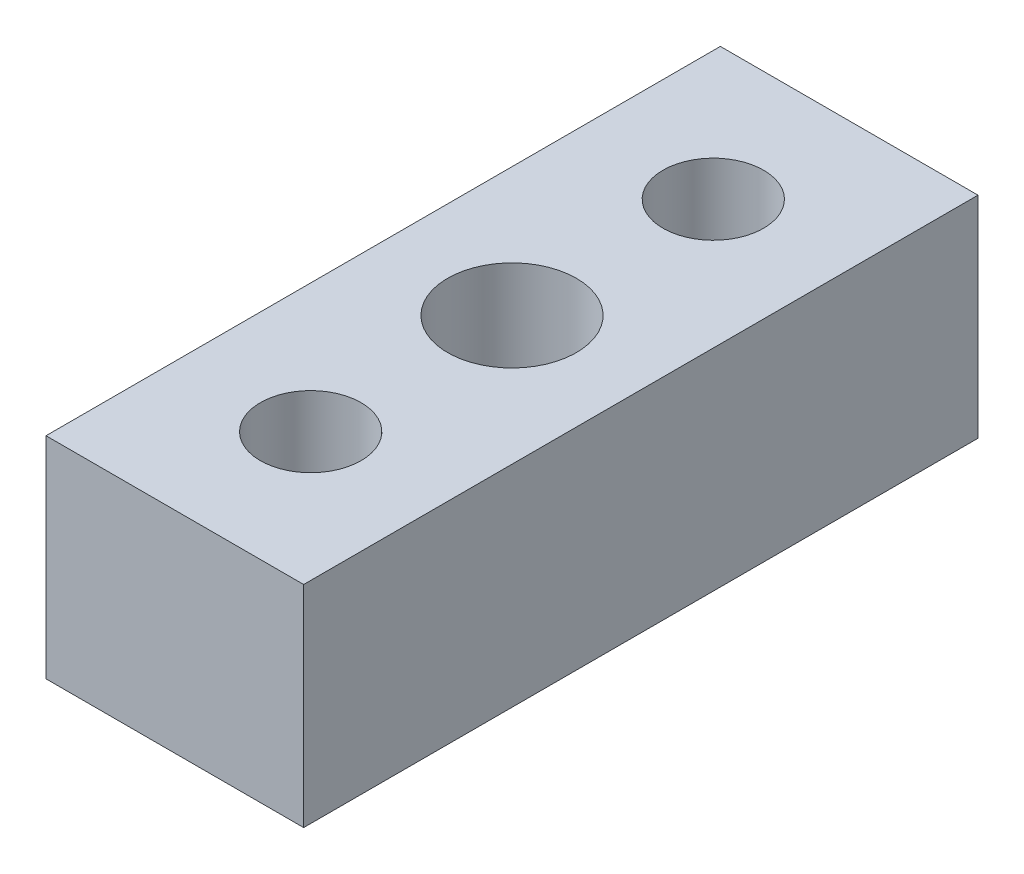
ISO-10303-21;
HEADER;
FILE_DESCRIPTION(('STEP AP214'),'2;1');
FILE_NAME('part.step','',(''),(''),'','','');
FILE_SCHEMA(('AUTOMOTIVE_DESIGN { 1 0 10303 214 1 1 1 1 }'));
ENDSEC;
DATA;
#1=APPLICATION_CONTEXT('core data for automotive mechanical design processes');
#2=APPLICATION_PROTOCOL_DEFINITION('international standard','automotive_design',2000,#1);
#3=PRODUCT_CONTEXT('',#1,'mechanical');
#4=PRODUCT('Part','Part','',(#3));
#5=PRODUCT_RELATED_PRODUCT_CATEGORY('part','',(#4));
#6=PRODUCT_DEFINITION_FORMATION('','',#4);
#7=PRODUCT_DEFINITION_CONTEXT('part definition',#1,'design');
#8=PRODUCT_DEFINITION('design','',#6,#7);
#9=PRODUCT_DEFINITION_SHAPE('','',#8);
#10=(LENGTH_UNIT() NAMED_UNIT(*) SI_UNIT(.MILLI.,.METRE.));
#11=(NAMED_UNIT(*) PLANE_ANGLE_UNIT() SI_UNIT($,.RADIAN.));
#12=(NAMED_UNIT(*) SI_UNIT($,.STERADIAN.) SOLID_ANGLE_UNIT());
#13=UNCERTAINTY_MEASURE_WITH_UNIT(LENGTH_MEASURE(1.E-05),#10,'distance_accuracy_value','');
#14=(GEOMETRIC_REPRESENTATION_CONTEXT(3) GLOBAL_UNCERTAINTY_ASSIGNED_CONTEXT((#13)) GLOBAL_UNIT_ASSIGNED_CONTEXT((#10,
#11,#12)) REPRESENTATION_CONTEXT('',''));
#15=CARTESIAN_POINT('',(0.,0.,0.));
#16=DIRECTION('',(0.,0.,1.));
#17=DIRECTION('',(1.,0.,0.));
#18=AXIS2_PLACEMENT_3D('',#15,#16,#17);
#19=CARTESIAN_POINT('',(-3.41700000000013,-2.11,8.37500000000002));
#20=DIRECTION('',(0.,0.,1.));
#21=DIRECTION('',(1.00000000000001,0.,0.));
#22=AXIS2_PLACEMENT_3D('',#19,#20,#21);
#23=PLANE('',#22);
#24=DIRECTION('',(1.00000000000001,0.,0.));
#25=VECTOR('',#24,1.);
#26=CARTESIAN_POINT('',(-3.41699999999999,3.12,8.37499999999996));
#27=LINE('',#26,#25);
#28=CARTESIAN_POINT('',(-3.20000000000002,3.12,8.37500000000002));
#29=VERTEX_POINT('',#28);
#30=CARTESIAN_POINT('',(3.20000000000013,3.12,8.37499999999998));
#31=VERTEX_POINT('',#30);
#32=EDGE_CURVE('E115',#29,#31,#27,.T.);
#33=ORIENTED_EDGE('',*,*,#32,.F.);
#34=DIRECTION('',(0.,-1.,0.));
#35=VECTOR('',#34,1.);
#36=CARTESIAN_POINT('',(-3.20000000000002,3.12,8.37500000000002));
#37=LINE('',#36,#35);
#38=CARTESIAN_POINT('',(-3.20000000000005,-2.11,8.37499999999999));
#39=VERTEX_POINT('',#38);
#40=EDGE_CURVE('E47',#29,#39,#37,.T.);
#41=ORIENTED_EDGE('',*,*,#40,.T.);
#42=DIRECTION('',(1.00000000000001,0.,0.));
#43=VECTOR('',#42,1.);
#44=CARTESIAN_POINT('',(-3.41700000000013,-2.11,8.37500000000002));
#45=LINE('',#44,#43);
#46=CARTESIAN_POINT('',(3.20000000000009,-2.11,8.375));
#47=VERTEX_POINT('',#46);
#48=EDGE_CURVE('E123',#39,#47,#45,.T.);
#49=ORIENTED_EDGE('',*,*,#48,.T.);
#50=DIRECTION('',(0.,-1.,0.));
#51=VECTOR('',#50,1.);
#52=CARTESIAN_POINT('',(3.20000000000013,3.12,8.37499999999998));
#53=LINE('',#52,#51);
#54=EDGE_CURVE('E225',#31,#47,#53,.T.);
#55=ORIENTED_EDGE('',*,*,#54,.F.);
#56=EDGE_LOOP('',(#33,#41,#49,#55));
#57=FACE_BOUND('',#56,.T.);
#58=ADVANCED_FACE('F32',(#57),#23,.T.);
#59=CARTESIAN_POINT('',(3.41700000000003,-2.11,-8.37500000000006));
#60=DIRECTION('',(0.,0.,-1.));
#61=DIRECTION('',(-1.00000000000001,0.,0.));
#62=AXIS2_PLACEMENT_3D('',#59,#60,#61);
#63=PLANE('',#62);
#64=DIRECTION('',(-1.00000000000001,0.,0.));
#65=VECTOR('',#64,1.);
#66=CARTESIAN_POINT('',(3.41700000000003,-2.11,-8.37500000000006));
#67=LINE('',#66,#65);
#68=CARTESIAN_POINT('',(3.20000000000005,-2.11,-8.37500000000006));
#69=VERTEX_POINT('',#68);
#70=CARTESIAN_POINT('',(-3.19999999999998,-2.11,-8.37500000000005));
#71=VERTEX_POINT('',#70);
#72=EDGE_CURVE('E111',#69,#71,#67,.T.);
#73=ORIENTED_EDGE('',*,*,#72,.T.);
#74=DIRECTION('',(0.,-1.,0.));
#75=VECTOR('',#74,1.);
#76=CARTESIAN_POINT('',(-3.1999999999999,3.12,-8.37500000000004));
#77=LINE('',#76,#75);
#78=CARTESIAN_POINT('',(-3.1999999999999,3.12,-8.37500000000004));
#79=VERTEX_POINT('',#78);
#80=EDGE_CURVE('E98',#79,#71,#77,.T.);
#81=ORIENTED_EDGE('',*,*,#80,.F.);
#82=DIRECTION('',(-1.00000000000001,0.,0.));
#83=VECTOR('',#82,1.);
#84=CARTESIAN_POINT('',(3.41700000000009,3.12,-8.37500000000009));
#85=LINE('',#84,#83);
#86=CARTESIAN_POINT('',(3.20000000000011,3.12,-8.37500000000012));
#87=VERTEX_POINT('',#86);
#88=EDGE_CURVE('E109',#87,#79,#85,.T.);
#89=ORIENTED_EDGE('',*,*,#88,.F.);
#90=DIRECTION('',(0.,-1.,0.));
#91=VECTOR('',#90,1.);
#92=CARTESIAN_POINT('',(3.20000000000011,3.12,-8.37500000000012));
#93=LINE('',#92,#91);
#94=EDGE_CURVE('E55',#87,#69,#93,.T.);
#95=ORIENTED_EDGE('',*,*,#94,.T.);
#96=EDGE_LOOP('',(#73,#81,#89,#95));
#97=FACE_BOUND('',#96,.T.);
#98=ADVANCED_FACE('F108',(#97),#63,.T.);
#99=CARTESIAN_POINT('',(3.41700000000003,-2.11,-8.37500000000006));
#100=DIRECTION('',(0.,1.,0.));
#101=DIRECTION('',(0.,0.,1.));
#102=AXIS2_PLACEMENT_3D('',#99,#100,#101);
#103=PLANE('',#102);
#104=DIRECTION('',(-1.00000000000001,0.,0.));
#105=VECTOR('',#104,1.);
#106=CARTESIAN_POINT('',(2.042,-2.11,6.99999999999997));
#107=LINE('',#106,#105);
#108=CARTESIAN_POINT('',(2.042,-2.11,6.99999999999997));
#109=VERTEX_POINT('',#108);
#110=CARTESIAN_POINT('',(-2.04199999999992,-2.11,7.00000000000003));
#111=VERTEX_POINT('',#110);
#112=EDGE_CURVE('E132',#109,#111,#107,.T.);
#113=ORIENTED_EDGE('',*,*,#112,.F.);
#114=DIRECTION('',(0.,0.,-1.));
#115=VECTOR('',#114,1.);
#116=CARTESIAN_POINT('',(2.042,-2.11,6.99999999999997));
#117=LINE('',#116,#115);
#118=CARTESIAN_POINT('',(2.04200000000013,-2.11,-7.00000000000005));
#119=VERTEX_POINT('',#118);
#120=EDGE_CURVE('E129',#109,#119,#117,.T.);
#121=ORIENTED_EDGE('',*,*,#120,.T.);
#122=DIRECTION('',(-1.00000000000001,0.,0.));
#123=VECTOR('',#122,1.);
#124=CARTESIAN_POINT('',(2.04200000000013,-2.11,-7.00000000000005));
#125=LINE('',#124,#123);
#126=CARTESIAN_POINT('',(-2.04199999999986,-2.11,-7.00000000000002));
#127=VERTEX_POINT('',#126);
#128=EDGE_CURVE('E11',#119,#127,#125,.T.);
#129=ORIENTED_EDGE('',*,*,#128,.T.);
#130=DIRECTION('',(0.,0.,1.));
#131=VECTOR('',#130,1.);
#132=CARTESIAN_POINT('',(-2.04199999999992,-2.11,7.00000000000003));
#133=LINE('',#132,#131);
#134=EDGE_CURVE('E126',#127,#111,#133,.T.);
#135=ORIENTED_EDGE('',*,*,#134,.T.);
#136=EDGE_LOOP('',(#113,#121,#129,#135));
#137=FACE_BOUND('',#136,.T.);
#138=DIRECTION('',(0.,0.,-1.));
#139=VECTOR('',#138,1.);
#140=CARTESIAN_POINT('',(-3.20000000000005,-2.11,8.37499999999999));
#141=LINE('',#140,#139);
#142=EDGE_CURVE('E103',#39,#71,#141,.T.);
#143=ORIENTED_EDGE('',*,*,#142,.T.);
#144=ORIENTED_EDGE('',*,*,#72,.F.);
#145=DIRECTION('',(0.,0.,-1.));
#146=VECTOR('',#145,1.);
#147=CARTESIAN_POINT('',(3.20000000000009,-2.11,8.375));
#148=LINE('',#147,#146);
#149=EDGE_CURVE('E228',#47,#69,#148,.T.);
#150=ORIENTED_EDGE('',*,*,#149,.F.);
#151=ORIENTED_EDGE('',*,*,#48,.F.);
#152=EDGE_LOOP('',(#143,#144,#150,#151));
#153=FACE_BOUND('',#152,.T.);
#154=ADVANCED_FACE('F165',(#137,#153),#103,.F.);
#155=CARTESIAN_POINT('',(-2.04199999999992,3.12,7.00000000000001));
#156=DIRECTION('',(0.,-1.,0.));
#157=DIRECTION('',(0.,0.,-1.));
#158=AXIS2_PLACEMENT_3D('',#155,#156,#157);
#159=PLANE('',#158);
#160=CARTESIAN_POINT('',(0.,3.12,0.));
#161=DIRECTION('',(0.,-1.,0.));
#162=DIRECTION('',(0.,0.,-1.));
#163=AXIS2_PLACEMENT_3D('',#160,#161,#162);
#164=CIRCLE('',#163,1.6);
#165=CARTESIAN_POINT('',(0.,3.12,-1.60000000000002));
#166=VERTEX_POINT('',#165);
#167=EDGE_CURVE('E120',#166,#166,#164,.T.);
#168=ORIENTED_EDGE('',*,*,#167,.T.);
#169=EDGE_LOOP('',(#168));
#170=FACE_BOUND('',#169,.T.);
#171=CARTESIAN_POINT('',(0.,3.12,4.99999999999994));
#172=DIRECTION('',(0.,-1.,0.));
#173=DIRECTION('',(1.00000000000001,0.,0.));
#174=AXIS2_PLACEMENT_3D('',#171,#172,#173);
#175=CIRCLE('',#174,1.25);
#176=CARTESIAN_POINT('',(1.25000000000005,3.12,4.99999999999994));
#177=VERTEX_POINT('',#176);
#178=EDGE_CURVE('E212',#177,#177,#175,.T.);
#179=ORIENTED_EDGE('',*,*,#178,.T.);
#180=EDGE_LOOP('',(#179));
#181=FACE_BOUND('',#180,.T.);
#182=CARTESIAN_POINT('',(0.,3.12,-5.00000000000006));
#183=DIRECTION('',(0.,-1.,0.));
#184=DIRECTION('',(-1.00000000000001,0.,0.));
#185=AXIS2_PLACEMENT_3D('',#182,#183,#184);
#186=CIRCLE('',#185,1.25);
#187=CARTESIAN_POINT('',(-1.24999999999998,3.12,-5.00000000000006));
#188=VERTEX_POINT('',#187);
#189=EDGE_CURVE('E213',#188,#188,#186,.T.);
#190=ORIENTED_EDGE('',*,*,#189,.T.);
#191=EDGE_LOOP('',(#190));
#192=FACE_BOUND('',#191,.T.);
#193=DIRECTION('',(0.,0.,-1.));
#194=VECTOR('',#193,1.);
#195=CARTESIAN_POINT('',(-3.20000000000002,3.12,8.37500000000002));
#196=LINE('',#195,#194);
#197=EDGE_CURVE('E95',#29,#79,#196,.T.);
#198=ORIENTED_EDGE('',*,*,#197,.F.);
#199=ORIENTED_EDGE('',*,*,#32,.T.);
#200=DIRECTION('',(0.,0.,-1.));
#201=VECTOR('',#200,1.);
#202=CARTESIAN_POINT('',(3.20000000000013,3.12,8.37499999999998));
#203=LINE('',#202,#201);
#204=EDGE_CURVE('E114',#31,#87,#203,.T.);
#205=ORIENTED_EDGE('',*,*,#204,.T.);
#206=ORIENTED_EDGE('',*,*,#88,.T.);
#207=EDGE_LOOP('',(#198,#199,#205,#206));
#208=FACE_BOUND('',#207,.T.);
#209=ADVANCED_FACE('F113',(#170,#181,#192,#208),#159,.F.);
#210=CARTESIAN_POINT('',(2.0420000000001,3.12,7.00000000000003));
#211=DIRECTION('',(-1.00000000000001,0.,0.));
#212=DIRECTION('',(0.,-1.,0.));
#213=AXIS2_PLACEMENT_3D('',#210,#211,#212);
#214=PLANE('',#213);
#215=ORIENTED_EDGE('',*,*,#120,.F.);
#216=DIRECTION('',(0.,1.,0.));
#217=VECTOR('',#216,1.);
#218=CARTESIAN_POINT('',(2.0420000000001,3.12,7.00000000000003));
#219=LINE('',#218,#217);
#220=CARTESIAN_POINT('',(2.04200000000006,-3.12,6.99999999999999));
#221=VERTEX_POINT('',#220);
#222=EDGE_CURVE('E138',#221,#109,#219,.T.);
#223=ORIENTED_EDGE('',*,*,#222,.F.);
#224=DIRECTION('',(0.,0.,-1.));
#225=VECTOR('',#224,1.);
#226=CARTESIAN_POINT('',(2.04200000000006,-3.12,6.99999999999999));
#227=LINE('',#226,#225);
#228=CARTESIAN_POINT('',(2.04200000000014,-3.12,-7.00000000000006));
#229=VERTEX_POINT('',#228);
#230=EDGE_CURVE('E40',#221,#229,#227,.T.);
#231=ORIENTED_EDGE('',*,*,#230,.T.);
#232=DIRECTION('',(0.,1.,0.));
#233=VECTOR('',#232,1.);
#234=CARTESIAN_POINT('',(2.04200000000013,3.12,-7.00000000000004));
#235=LINE('',#234,#233);
#236=EDGE_CURVE('E147',#229,#119,#235,.T.);
#237=ORIENTED_EDGE('',*,*,#236,.T.);
#238=EDGE_LOOP('',(#215,#223,#231,#237));
#239=FACE_BOUND('',#238,.T.);
#240=ADVANCED_FACE('F155',(#239),#214,.F.);
#241=CARTESIAN_POINT('',(-2.04199999999989,-3.12,7.00000000000004));
#242=DIRECTION('',(1.00000000000001,0.,0.));
#243=DIRECTION('',(0.,0.,-1.));
#244=AXIS2_PLACEMENT_3D('',#241,#242,#243);
#245=PLANE('',#244);
#246=ORIENTED_EDGE('',*,*,#134,.F.);
#247=DIRECTION('',(0.,-1.,0.));
#248=VECTOR('',#247,1.);
#249=CARTESIAN_POINT('',(-2.04199999999988,-3.12,-7.));
#250=LINE('',#249,#248);
#251=CARTESIAN_POINT('',(-2.04199999999988,-3.12,-7.));
#252=VERTEX_POINT('',#251);
#253=EDGE_CURVE('E139',#127,#252,#250,.T.);
#254=ORIENTED_EDGE('',*,*,#253,.T.);
#255=DIRECTION('',(0.,0.,-1.));
#256=VECTOR('',#255,1.);
#257=CARTESIAN_POINT('',(-2.04199999999989,-3.12,7.00000000000004));
#258=LINE('',#257,#256);
#259=CARTESIAN_POINT('',(-2.04199999999989,-3.12,7.00000000000004));
#260=VERTEX_POINT('',#259);
#261=EDGE_CURVE('E144',#260,#252,#258,.T.);
#262=ORIENTED_EDGE('',*,*,#261,.F.);
#263=DIRECTION('',(0.,-1.,0.));
#264=VECTOR('',#263,1.);
#265=CARTESIAN_POINT('',(-2.04199999999989,-3.12,7.00000000000004));
#266=LINE('',#265,#264);
#267=EDGE_CURVE('E142',#111,#260,#266,.T.);
#268=ORIENTED_EDGE('',*,*,#267,.F.);
#269=EDGE_LOOP('',(#246,#254,#262,#268));
#270=FACE_BOUND('',#269,.T.);
#271=ADVANCED_FACE('F171',(#270),#245,.F.);
#272=CARTESIAN_POINT('',(2.04200000000006,-3.12,6.99999999999999));
#273=DIRECTION('',(0.,0.,1.));
#274=DIRECTION('',(1.00000000000001,0.,0.));
#275=AXIS2_PLACEMENT_3D('',#272,#273,#274);
#276=PLANE('',#275);
#277=ORIENTED_EDGE('',*,*,#222,.T.);
#278=ORIENTED_EDGE('',*,*,#112,.T.);
#279=ORIENTED_EDGE('',*,*,#267,.T.);
#280=DIRECTION('',(1.00000000000001,0.,0.));
#281=VECTOR('',#280,1.);
#282=CARTESIAN_POINT('',(2.04200000000006,-3.12,6.99999999999999));
#283=LINE('',#282,#281);
#284=EDGE_CURVE('E135',#260,#221,#283,.T.);
#285=ORIENTED_EDGE('',*,*,#284,.T.);
#286=EDGE_LOOP('',(#277,#278,#279,#285));
#287=FACE_BOUND('',#286,.T.);
#288=ADVANCED_FACE('F168',(#287),#276,.T.);
#289=CARTESIAN_POINT('',(2.04200000000014,-3.12,-7.00000000000006));
#290=DIRECTION('',(0.,0.,1.));
#291=DIRECTION('',(1.00000000000001,0.,0.));
#292=AXIS2_PLACEMENT_3D('',#289,#290,#291);
#293=PLANE('',#292);
#294=ORIENTED_EDGE('',*,*,#128,.F.);
#295=ORIENTED_EDGE('',*,*,#236,.F.);
#296=DIRECTION('',(1.00000000000001,0.,0.));
#297=VECTOR('',#296,1.);
#298=CARTESIAN_POINT('',(2.04200000000014,-3.12,-7.00000000000006));
#299=LINE('',#298,#297);
#300=EDGE_CURVE('E134',#252,#229,#299,.T.);
#301=ORIENTED_EDGE('',*,*,#300,.F.);
#302=ORIENTED_EDGE('',*,*,#253,.F.);
#303=EDGE_LOOP('',(#294,#295,#301,#302));
#304=FACE_BOUND('',#303,.T.);
#305=ADVANCED_FACE('F161',(#304),#293,.F.);
#306=CARTESIAN_POINT('',(2.04200000000006,-3.12,6.99999999999999));
#307=DIRECTION('',(0.,1.,0.));
#308=DIRECTION('',(-1.00000000000001,0.,0.));
#309=AXIS2_PLACEMENT_3D('',#306,#307,#308);
#310=PLANE('',#309);
#311=CARTESIAN_POINT('',(0.,-3.12,-5.));
#312=DIRECTION('',(0.,-1.,0.));
#313=DIRECTION('',(-1.00000000000001,0.,0.));
#314=AXIS2_PLACEMENT_3D('',#311,#312,#313);
#315=CIRCLE('',#314,1.25);
#316=CARTESIAN_POINT('',(-1.24999999999999,-3.12,-5.));
#317=VERTEX_POINT('',#316);
#318=EDGE_CURVE('E204',#317,#317,#315,.T.);
#319=ORIENTED_EDGE('',*,*,#318,.F.);
#320=EDGE_LOOP('',(#319));
#321=FACE_BOUND('',#320,.T.);
#322=CARTESIAN_POINT('',(0.,-3.12,5.00000000000002));
#323=DIRECTION('',(0.,-1.,0.));
#324=DIRECTION('',(1.00000000000001,0.,0.));
#325=AXIS2_PLACEMENT_3D('',#322,#323,#324);
#326=CIRCLE('',#325,1.25);
#327=CARTESIAN_POINT('',(1.25000000000008,-3.12,5.00000000000002));
#328=VERTEX_POINT('',#327);
#329=EDGE_CURVE('E208',#328,#328,#326,.T.);
#330=ORIENTED_EDGE('',*,*,#329,.F.);
#331=EDGE_LOOP('',(#330));
#332=FACE_BOUND('',#331,.T.);
#333=CARTESIAN_POINT('',(0.,-3.12,0.));
#334=DIRECTION('',(0.,-1.,0.));
#335=DIRECTION('',(0.,0.,-1.));
#336=AXIS2_PLACEMENT_3D('',#333,#334,#335);
#337=CIRCLE('',#336,1.6);
#338=CARTESIAN_POINT('',(0.,-3.12,-1.60000000000002));
#339=VERTEX_POINT('',#338);
#340=EDGE_CURVE('E116',#339,#339,#337,.T.);
#341=ORIENTED_EDGE('',*,*,#340,.F.);
#342=EDGE_LOOP('',(#341));
#343=FACE_BOUND('',#342,.T.);
#344=ORIENTED_EDGE('',*,*,#300,.T.);
#345=ORIENTED_EDGE('',*,*,#230,.F.);
#346=ORIENTED_EDGE('',*,*,#284,.F.);
#347=ORIENTED_EDGE('',*,*,#261,.T.);
#348=EDGE_LOOP('',(#344,#345,#346,#347));
#349=FACE_BOUND('',#348,.T.);
#350=ADVANCED_FACE('F34',(#321,#332,#343,#349),#310,.F.);
#351=CARTESIAN_POINT('',(0.,-3.12,0.));
#352=DIRECTION('',(0.,-1.,0.));
#353=DIRECTION('',(0.,0.,-1.));
#354=AXIS2_PLACEMENT_3D('',#351,#352,#353);
#355=CYLINDRICAL_SURFACE('',#354,1.6);
#356=ORIENTED_EDGE('',*,*,#167,.F.);
#357=EDGE_LOOP('',(#356));
#358=FACE_BOUND('',#357,.T.);
#359=ORIENTED_EDGE('',*,*,#340,.T.);
#360=EDGE_LOOP('',(#359));
#361=FACE_BOUND('',#360,.T.);
#362=ADVANCED_FACE('F194',(#358,#361),#355,.F.);
#363=CARTESIAN_POINT('',(0.,3.12,4.99999999999994));
#364=DIRECTION('',(0.,-1.,0.));
#365=DIRECTION('',(1.00000000000001,0.,0.));
#366=AXIS2_PLACEMENT_3D('',#363,#364,#365);
#367=CYLINDRICAL_SURFACE('',#366,1.25);
#368=ORIENTED_EDGE('',*,*,#178,.F.);
#369=EDGE_LOOP('',(#368));
#370=FACE_BOUND('',#369,.T.);
#371=ORIENTED_EDGE('',*,*,#329,.T.);
#372=EDGE_LOOP('',(#371));
#373=FACE_BOUND('',#372,.T.);
#374=ADVANCED_FACE('F199',(#370,#373),#367,.F.);
#375=CARTESIAN_POINT('',(0.,3.12,-5.00000000000006));
#376=DIRECTION('',(0.,-1.,0.));
#377=DIRECTION('',(1.00000000000001,0.,0.));
#378=AXIS2_PLACEMENT_3D('',#375,#376,#377);
#379=CYLINDRICAL_SURFACE('',#378,1.25);
#380=ORIENTED_EDGE('',*,*,#189,.F.);
#381=EDGE_LOOP('',(#380));
#382=FACE_BOUND('',#381,.T.);
#383=ORIENTED_EDGE('',*,*,#318,.T.);
#384=EDGE_LOOP('',(#383));
#385=FACE_BOUND('',#384,.T.);
#386=ADVANCED_FACE('F235',(#382,#385),#379,.F.);
#387=CARTESIAN_POINT('',(3.20000000000013,3.12,8.37499999999998));
#388=DIRECTION('',(-1.00000000000001,0.,0.));
#389=DIRECTION('',(0.,0.,1.));
#390=AXIS2_PLACEMENT_3D('',#387,#388,#389);
#391=PLANE('',#390);
#392=ORIENTED_EDGE('',*,*,#149,.T.);
#393=ORIENTED_EDGE('',*,*,#94,.F.);
#394=ORIENTED_EDGE('',*,*,#204,.F.);
#395=ORIENTED_EDGE('',*,*,#54,.T.);
#396=EDGE_LOOP('',(#392,#393,#394,#395));
#397=FACE_BOUND('',#396,.T.);
#398=ADVANCED_FACE('F227',(#397),#391,.F.);
#399=CARTESIAN_POINT('',(-3.20000000000002,3.12,8.37500000000002));
#400=DIRECTION('',(-1.,0.,0.));
#401=DIRECTION('',(0.,0.,1.));
#402=AXIS2_PLACEMENT_3D('',#399,#400,#401);
#403=PLANE('',#402);
#404=ORIENTED_EDGE('',*,*,#142,.F.);
#405=ORIENTED_EDGE('',*,*,#40,.F.);
#406=ORIENTED_EDGE('',*,*,#197,.T.);
#407=ORIENTED_EDGE('',*,*,#80,.T.);
#408=EDGE_LOOP('',(#404,#405,#406,#407));
#409=FACE_BOUND('',#408,.T.);
#410=ADVANCED_FACE('F97',(#409),#403,.T.);
#411=CLOSED_SHELL('',(#58,#98,#154,#209,#240,#271,#288,#305,#350,#362,#374,#386,#398,#410));
#412=MANIFOLD_SOLID_BREP('B2',#411);
#413=ADVANCED_BREP_SHAPE_REPRESENTATION('',(#18,#412),#14);
#414=SHAPE_DEFINITION_REPRESENTATION(#9,#413);
ENDSEC;
END-ISO-10303-21;
